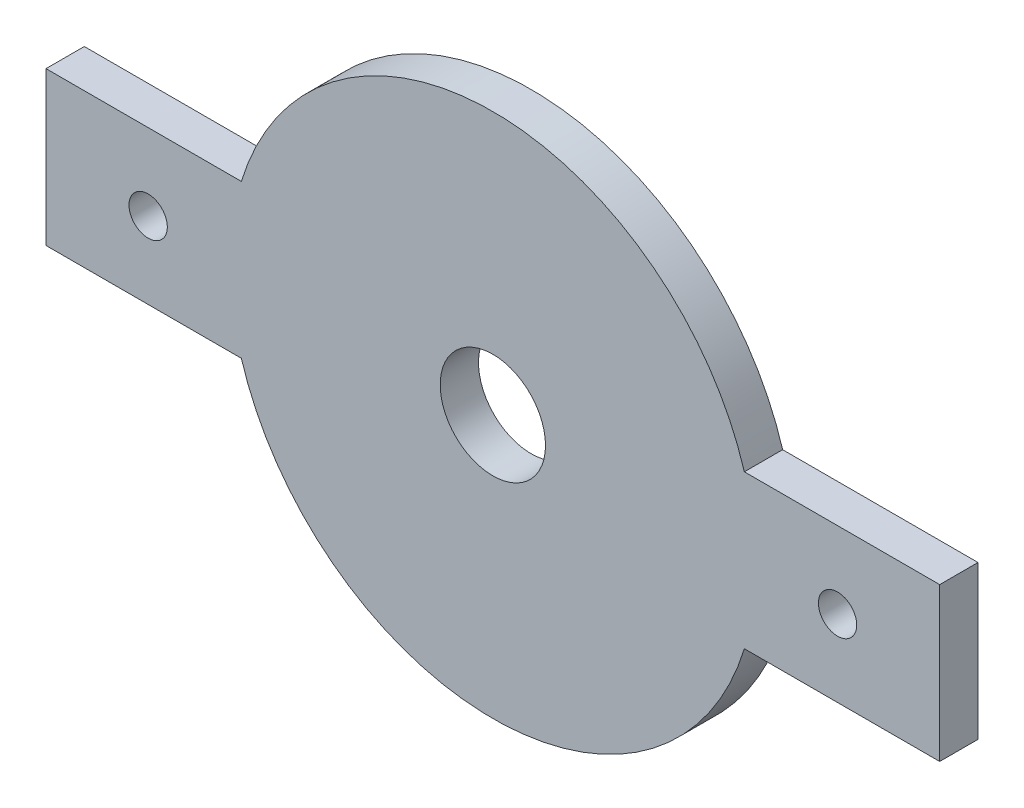
ISO-10303-21;
HEADER;
FILE_DESCRIPTION(('STEP AP214'),'2;1');
FILE_NAME('part.step','',(''),(''),'','','');
FILE_SCHEMA(('AUTOMOTIVE_DESIGN { 1 0 10303 214 1 1 1 1 }'));
ENDSEC;
DATA;
#1=APPLICATION_CONTEXT('core data for automotive mechanical design processes');
#2=APPLICATION_PROTOCOL_DEFINITION('international standard','automotive_design',2000,#1);
#3=PRODUCT_CONTEXT('',#1,'mechanical');
#4=PRODUCT('Part','Part','',(#3));
#5=PRODUCT_RELATED_PRODUCT_CATEGORY('part','',(#4));
#6=PRODUCT_DEFINITION_FORMATION('','',#4);
#7=PRODUCT_DEFINITION_CONTEXT('part definition',#1,'design');
#8=PRODUCT_DEFINITION('design','',#6,#7);
#9=PRODUCT_DEFINITION_SHAPE('','',#8);
#10=(LENGTH_UNIT() NAMED_UNIT(*) SI_UNIT(.MILLI.,.METRE.));
#11=(NAMED_UNIT(*) PLANE_ANGLE_UNIT() SI_UNIT($,.RADIAN.));
#12=(NAMED_UNIT(*) SI_UNIT($,.STERADIAN.) SOLID_ANGLE_UNIT());
#13=UNCERTAINTY_MEASURE_WITH_UNIT(LENGTH_MEASURE(1.E-05),#10,'distance_accuracy_value','');
#14=(GEOMETRIC_REPRESENTATION_CONTEXT(3) GLOBAL_UNCERTAINTY_ASSIGNED_CONTEXT((#13)) GLOBAL_UNIT_ASSIGNED_CONTEXT((#10,
#11,#12)) REPRESENTATION_CONTEXT('',''));
#15=CARTESIAN_POINT('',(0.,0.,0.));
#16=DIRECTION('',(0.,0.,1.));
#17=DIRECTION('',(1.,0.,0.));
#18=AXIS2_PLACEMENT_3D('',#15,#16,#17);
#19=CARTESIAN_POINT('',(0.,0.,4.));
#20=DIRECTION('',(0.,0.,-1.));
#21=DIRECTION('',(-1.,0.,0.));
#22=AXIS2_PLACEMENT_3D('',#19,#20,#21);
#23=CYLINDRICAL_SURFACE('',#22,20.5921091631052);
#24=CARTESIAN_POINT('',(0.,0.,4.));
#25=DIRECTION('',(0.,0.,1.));
#26=DIRECTION('',(1.,0.,0.));
#27=AXIS2_PLACEMENT_3D('',#24,#25,#26);
#28=CIRCLE('',#27,20.5921091631052);
#29=CARTESIAN_POINT('',(-19.6986029907007,-6.,4.));
#30=VERTEX_POINT('',#29);
#31=CARTESIAN_POINT('',(19.6986029907007,-6.,4.));
#32=VERTEX_POINT('',#31);
#33=EDGE_CURVE('E61',#30,#32,#28,.T.);
#34=ORIENTED_EDGE('',*,*,#33,.F.);
#35=DIRECTION('',(0.,0.,-1.));
#36=VECTOR('',#35,1.);
#37=CARTESIAN_POINT('',(-19.6986029907007,-6.,4.));
#38=LINE('',#37,#36);
#39=CARTESIAN_POINT('',(-19.6986029907007,-6.,1.));
#40=VERTEX_POINT('',#39);
#41=EDGE_CURVE('E179',#30,#40,#38,.T.);
#42=ORIENTED_EDGE('',*,*,#41,.T.);
#43=CARTESIAN_POINT('',(0.,0.,1.));
#44=DIRECTION('',(0.,0.,1.));
#45=DIRECTION('',(1.,0.,0.));
#46=AXIS2_PLACEMENT_3D('',#43,#44,#45);
#47=CIRCLE('',#46,20.5921091631052);
#48=CARTESIAN_POINT('',(19.6986029907007,-6.,1.));
#49=VERTEX_POINT('',#48);
#50=EDGE_CURVE('E69',#40,#49,#47,.T.);
#51=ORIENTED_EDGE('',*,*,#50,.T.);
#52=DIRECTION('',(0.,0.,-1.));
#53=VECTOR('',#52,1.);
#54=CARTESIAN_POINT('',(19.6986029907007,-6.,4.));
#55=LINE('',#54,#53);
#56=EDGE_CURVE('E177',#49,#32,#55,.F.);
#57=ORIENTED_EDGE('',*,*,#56,.T.);
#58=EDGE_LOOP('',(#34,#42,#51,#57));
#59=FACE_BOUND('',#58,.T.);
#60=ADVANCED_FACE('F52',(#59),#23,.T.);
#61=CARTESIAN_POINT('',(0.,0.,1.));
#62=DIRECTION('',(0.,0.,1.));
#63=DIRECTION('',(1.,0.,0.));
#64=AXIS2_PLACEMENT_3D('',#61,#62,#63);
#65=PLANE('',#64);
#66=CARTESIAN_POINT('',(19.6986029907007,6.,1.));
#67=VERTEX_POINT('',#66);
#68=CARTESIAN_POINT('',(-19.6986029907007,6.,1.));
#69=VERTEX_POINT('',#68);
#70=EDGE_CURVE('E77',#67,#69,#47,.T.);
#71=ORIENTED_EDGE('',*,*,#70,.F.);
#72=DIRECTION('',(1.,0.,0.));
#73=VECTOR('',#72,1.);
#74=CARTESIAN_POINT('',(35.,6.,1.));
#75=LINE('',#74,#73);
#76=CARTESIAN_POINT('',(35.,6.,1.));
#77=VERTEX_POINT('',#76);
#78=EDGE_CURVE('E162',#67,#77,#75,.T.);
#79=ORIENTED_EDGE('',*,*,#78,.T.);
#80=DIRECTION('',(0.,-1.,0.));
#81=VECTOR('',#80,1.);
#82=CARTESIAN_POINT('',(35.,-6.,1.));
#83=LINE('',#82,#81);
#84=CARTESIAN_POINT('',(35.,-6.,1.));
#85=VERTEX_POINT('',#84);
#86=EDGE_CURVE('E165',#77,#85,#83,.T.);
#87=ORIENTED_EDGE('',*,*,#86,.T.);
#88=DIRECTION('',(-1.,0.,0.));
#89=VECTOR('',#88,1.);
#90=CARTESIAN_POINT('',(35.,-6.,1.));
#91=LINE('',#90,#89);
#92=EDGE_CURVE('E146',#85,#49,#91,.T.);
#93=ORIENTED_EDGE('',*,*,#92,.T.);
#94=ORIENTED_EDGE('',*,*,#50,.F.);
#95=CARTESIAN_POINT('',(-35.,-6.,1.));
#96=VERTEX_POINT('',#95);
#97=EDGE_CURVE('E149',#40,#96,#91,.T.);
#98=ORIENTED_EDGE('',*,*,#97,.T.);
#99=DIRECTION('',(0.,1.,0.));
#100=VECTOR('',#99,1.);
#101=CARTESIAN_POINT('',(-35.,-6.,1.));
#102=LINE('',#101,#100);
#103=CARTESIAN_POINT('',(-35.,6.,1.));
#104=VERTEX_POINT('',#103);
#105=EDGE_CURVE('E160',#96,#104,#102,.T.);
#106=ORIENTED_EDGE('',*,*,#105,.T.);
#107=EDGE_CURVE('E124',#104,#69,#75,.T.);
#108=ORIENTED_EDGE('',*,*,#107,.T.);
#109=EDGE_LOOP('',(#71,#79,#87,#93,#94,#98,#106,#108));
#110=FACE_BOUND('',#109,.T.);
#111=CARTESIAN_POINT('',(0.,0.,1.));
#112=DIRECTION('',(0.,0.,1.));
#113=DIRECTION('',(1.,0.,0.));
#114=AXIS2_PLACEMENT_3D('',#111,#112,#113);
#115=CIRCLE('',#114,4.125);
#116=CARTESIAN_POINT('',(4.125,0.,1.));
#117=VERTEX_POINT('',#116);
#118=EDGE_CURVE('E56',#117,#117,#115,.T.);
#119=ORIENTED_EDGE('',*,*,#118,.T.);
#120=EDGE_LOOP('',(#119));
#121=FACE_BOUND('',#120,.T.);
#122=CARTESIAN_POINT('',(27.,0.,1.));
#123=DIRECTION('',(0.,0.,-1.));
#124=DIRECTION('',(-1.,0.,0.));
#125=AXIS2_PLACEMENT_3D('',#122,#123,#124);
#126=CIRCLE('',#125,1.5);
#127=CARTESIAN_POINT('',(25.5,0.,1.));
#128=VERTEX_POINT('',#127);
#129=EDGE_CURVE('E152',#128,#128,#126,.T.);
#130=ORIENTED_EDGE('',*,*,#129,.F.);
#131=EDGE_LOOP('',(#130));
#132=FACE_BOUND('',#131,.T.);
#133=CARTESIAN_POINT('',(-27.,0.,1.));
#134=DIRECTION('',(0.,0.,-1.));
#135=DIRECTION('',(-1.,0.,0.));
#136=AXIS2_PLACEMENT_3D('',#133,#134,#135);
#137=CIRCLE('',#136,1.5);
#138=CARTESIAN_POINT('',(-28.5,0.,1.));
#139=VERTEX_POINT('',#138);
#140=EDGE_CURVE('E255',#139,#139,#137,.T.);
#141=ORIENTED_EDGE('',*,*,#140,.F.);
#142=EDGE_LOOP('',(#141));
#143=FACE_BOUND('',#142,.T.);
#144=ADVANCED_FACE('F188',(#110,#121,#132,#143),#65,.F.);
#145=CARTESIAN_POINT('',(19.6986029907007,6.,4.));
#146=VERTEX_POINT('',#145);
#147=CARTESIAN_POINT('',(-19.6986029907007,6.,4.));
#148=VERTEX_POINT('',#147);
#149=EDGE_CURVE('E12',#146,#148,#28,.T.);
#150=ORIENTED_EDGE('',*,*,#149,.F.);
#151=DIRECTION('',(0.,0.,-1.));
#152=VECTOR('',#151,1.);
#153=CARTESIAN_POINT('',(19.6986029907007,6.,4.));
#154=LINE('',#153,#152);
#155=EDGE_CURVE('E175',#146,#67,#154,.T.);
#156=ORIENTED_EDGE('',*,*,#155,.T.);
#157=ORIENTED_EDGE('',*,*,#70,.T.);
#158=DIRECTION('',(0.,0.,-1.));
#159=VECTOR('',#158,1.);
#160=CARTESIAN_POINT('',(-19.6986029907007,6.,4.));
#161=LINE('',#160,#159);
#162=EDGE_CURVE('E169',#69,#148,#161,.F.);
#163=ORIENTED_EDGE('',*,*,#162,.T.);
#164=EDGE_LOOP('',(#150,#156,#157,#163));
#165=FACE_BOUND('',#164,.T.);
#166=ADVANCED_FACE('F202',(#165),#23,.T.);
#167=CARTESIAN_POINT('',(0.,0.,4.));
#168=DIRECTION('',(0.,0.,1.));
#169=DIRECTION('',(1.,0.,0.));
#170=AXIS2_PLACEMENT_3D('',#167,#168,#169);
#171=PLANE('',#170);
#172=ORIENTED_EDGE('',*,*,#149,.T.);
#173=DIRECTION('',(1.,0.,0.));
#174=VECTOR('',#173,1.);
#175=CARTESIAN_POINT('',(35.,6.,4.));
#176=LINE('',#175,#174);
#177=CARTESIAN_POINT('',(-35.,6.,4.));
#178=VERTEX_POINT('',#177);
#179=EDGE_CURVE('E122',#178,#148,#176,.T.);
#180=ORIENTED_EDGE('',*,*,#179,.F.);
#181=DIRECTION('',(0.,1.,0.));
#182=VECTOR('',#181,1.);
#183=CARTESIAN_POINT('',(-35.,-6.,4.));
#184=LINE('',#183,#182);
#185=CARTESIAN_POINT('',(-35.,-6.,4.));
#186=VERTEX_POINT('',#185);
#187=EDGE_CURVE('E137',#186,#178,#184,.T.);
#188=ORIENTED_EDGE('',*,*,#187,.F.);
#189=DIRECTION('',(-1.,0.,0.));
#190=VECTOR('',#189,1.);
#191=CARTESIAN_POINT('',(35.,-6.,4.));
#192=LINE('',#191,#190);
#193=EDGE_CURVE('E157',#30,#186,#192,.T.);
#194=ORIENTED_EDGE('',*,*,#193,.F.);
#195=ORIENTED_EDGE('',*,*,#33,.T.);
#196=CARTESIAN_POINT('',(35.,-6.,4.));
#197=VERTEX_POINT('',#196);
#198=EDGE_CURVE('E130',#197,#32,#192,.T.);
#199=ORIENTED_EDGE('',*,*,#198,.F.);
#200=DIRECTION('',(0.,-1.,0.));
#201=VECTOR('',#200,1.);
#202=CARTESIAN_POINT('',(35.,-6.,4.));
#203=LINE('',#202,#201);
#204=CARTESIAN_POINT('',(35.,6.,4.));
#205=VERTEX_POINT('',#204);
#206=EDGE_CURVE('E139',#205,#197,#203,.T.);
#207=ORIENTED_EDGE('',*,*,#206,.F.);
#208=EDGE_CURVE('E140',#146,#205,#176,.T.);
#209=ORIENTED_EDGE('',*,*,#208,.F.);
#210=EDGE_LOOP('',(#172,#180,#188,#194,#195,#199,#207,#209));
#211=FACE_BOUND('',#210,.T.);
#212=CARTESIAN_POINT('',(0.,0.,4.));
#213=DIRECTION('',(0.,0.,1.));
#214=DIRECTION('',(1.,0.,0.));
#215=AXIS2_PLACEMENT_3D('',#212,#213,#214);
#216=CIRCLE('',#215,4.125);
#217=CARTESIAN_POINT('',(4.125,0.,4.));
#218=VERTEX_POINT('',#217);
#219=EDGE_CURVE('E181',#218,#218,#216,.T.);
#220=ORIENTED_EDGE('',*,*,#219,.F.);
#221=EDGE_LOOP('',(#220));
#222=FACE_BOUND('',#221,.T.);
#223=CARTESIAN_POINT('',(27.,0.,4.));
#224=DIRECTION('',(0.,0.,-1.));
#225=DIRECTION('',(-1.,0.,0.));
#226=AXIS2_PLACEMENT_3D('',#223,#224,#225);
#227=CIRCLE('',#226,1.5);
#228=CARTESIAN_POINT('',(25.5,0.,4.));
#229=VERTEX_POINT('',#228);
#230=EDGE_CURVE('E163',#229,#229,#227,.T.);
#231=ORIENTED_EDGE('',*,*,#230,.T.);
#232=EDGE_LOOP('',(#231));
#233=FACE_BOUND('',#232,.T.);
#234=CARTESIAN_POINT('',(-27.,0.,4.));
#235=DIRECTION('',(0.,0.,-1.));
#236=DIRECTION('',(-1.,0.,0.));
#237=AXIS2_PLACEMENT_3D('',#234,#235,#236);
#238=CIRCLE('',#237,1.5);
#239=CARTESIAN_POINT('',(-28.5,0.,4.));
#240=VERTEX_POINT('',#239);
#241=EDGE_CURVE('E252',#240,#240,#238,.T.);
#242=ORIENTED_EDGE('',*,*,#241,.T.);
#243=EDGE_LOOP('',(#242));
#244=FACE_BOUND('',#243,.T.);
#245=ADVANCED_FACE('F134',(#211,#222,#233,#244),#171,.T.);
#246=CARTESIAN_POINT('',(0.,0.,4.));
#247=DIRECTION('',(0.,0.,-1.));
#248=DIRECTION('',(-1.,0.,0.));
#249=AXIS2_PLACEMENT_3D('',#246,#247,#248);
#250=CYLINDRICAL_SURFACE('',#249,4.125);
#251=ORIENTED_EDGE('',*,*,#219,.T.);
#252=EDGE_LOOP('',(#251));
#253=FACE_BOUND('',#252,.T.);
#254=ORIENTED_EDGE('',*,*,#118,.F.);
#255=EDGE_LOOP('',(#254));
#256=FACE_BOUND('',#255,.T.);
#257=ADVANCED_FACE('F54',(#253,#256),#250,.F.);
#258=CARTESIAN_POINT('',(35.,-6.,4.));
#259=DIRECTION('',(1.,0.,0.));
#260=DIRECTION('',(0.,0.,-1.));
#261=AXIS2_PLACEMENT_3D('',#258,#259,#260);
#262=PLANE('',#261);
#263=ORIENTED_EDGE('',*,*,#86,.F.);
#264=DIRECTION('',(0.,0.,-1.));
#265=VECTOR('',#264,1.);
#266=CARTESIAN_POINT('',(35.,6.,4.));
#267=LINE('',#266,#265);
#268=EDGE_CURVE('E129',#205,#77,#267,.T.);
#269=ORIENTED_EDGE('',*,*,#268,.F.);
#270=ORIENTED_EDGE('',*,*,#206,.T.);
#271=DIRECTION('',(0.,0.,-1.));
#272=VECTOR('',#271,1.);
#273=CARTESIAN_POINT('',(35.,-6.,4.));
#274=LINE('',#273,#272);
#275=EDGE_CURVE('E170',#197,#85,#274,.T.);
#276=ORIENTED_EDGE('',*,*,#275,.T.);
#277=EDGE_LOOP('',(#263,#269,#270,#276));
#278=FACE_BOUND('',#277,.T.);
#279=ADVANCED_FACE('F192',(#278),#262,.T.);
#280=CARTESIAN_POINT('',(27.,0.,4.));
#281=DIRECTION('',(0.,0.,-1.));
#282=DIRECTION('',(-1.,0.,0.));
#283=AXIS2_PLACEMENT_3D('',#280,#281,#282);
#284=CYLINDRICAL_SURFACE('',#283,1.5);
#285=ORIENTED_EDGE('',*,*,#230,.F.);
#286=EDGE_LOOP('',(#285));
#287=FACE_BOUND('',#286,.T.);
#288=ORIENTED_EDGE('',*,*,#129,.T.);
#289=EDGE_LOOP('',(#288));
#290=FACE_BOUND('',#289,.T.);
#291=ADVANCED_FACE('F198',(#287,#290),#284,.F.);
#292=CARTESIAN_POINT('',(35.,6.,4.));
#293=DIRECTION('',(0.,1.,0.));
#294=DIRECTION('',(0.,0.,1.));
#295=AXIS2_PLACEMENT_3D('',#292,#293,#294);
#296=PLANE('',#295);
#297=ORIENTED_EDGE('',*,*,#155,.F.);
#298=ORIENTED_EDGE('',*,*,#208,.T.);
#299=ORIENTED_EDGE('',*,*,#268,.T.);
#300=ORIENTED_EDGE('',*,*,#78,.F.);
#301=EDGE_LOOP('',(#297,#298,#299,#300));
#302=FACE_BOUND('',#301,.T.);
#303=ADVANCED_FACE('F217',(#302),#296,.T.);
#304=CARTESIAN_POINT('',(35.,-6.,4.));
#305=DIRECTION('',(0.,-1.,0.));
#306=DIRECTION('',(0.,0.,-1.));
#307=AXIS2_PLACEMENT_3D('',#304,#305,#306);
#308=PLANE('',#307);
#309=ORIENTED_EDGE('',*,*,#56,.F.);
#310=ORIENTED_EDGE('',*,*,#92,.F.);
#311=ORIENTED_EDGE('',*,*,#275,.F.);
#312=ORIENTED_EDGE('',*,*,#198,.T.);
#313=EDGE_LOOP('',(#309,#310,#311,#312));
#314=FACE_BOUND('',#313,.T.);
#315=ADVANCED_FACE('F225',(#314),#308,.T.);
#316=ORIENTED_EDGE('',*,*,#41,.F.);
#317=ORIENTED_EDGE('',*,*,#193,.T.);
#318=DIRECTION('',(0.,0.,-1.));
#319=VECTOR('',#318,1.);
#320=CARTESIAN_POINT('',(-35.,-6.,4.));
#321=LINE('',#320,#319);
#322=EDGE_CURVE('E145',#186,#96,#321,.T.);
#323=ORIENTED_EDGE('',*,*,#322,.T.);
#324=ORIENTED_EDGE('',*,*,#97,.F.);
#325=EDGE_LOOP('',(#316,#317,#323,#324));
#326=FACE_BOUND('',#325,.T.);
#327=ADVANCED_FACE('F228',(#326),#308,.T.);
#328=ORIENTED_EDGE('',*,*,#162,.F.);
#329=ORIENTED_EDGE('',*,*,#107,.F.);
#330=DIRECTION('',(0.,0.,-1.));
#331=VECTOR('',#330,1.);
#332=CARTESIAN_POINT('',(-35.,6.,4.));
#333=LINE('',#332,#331);
#334=EDGE_CURVE('E119',#178,#104,#333,.T.);
#335=ORIENTED_EDGE('',*,*,#334,.F.);
#336=ORIENTED_EDGE('',*,*,#179,.T.);
#337=EDGE_LOOP('',(#328,#329,#335,#336));
#338=FACE_BOUND('',#337,.T.);
#339=ADVANCED_FACE('F121',(#338),#296,.T.);
#340=CARTESIAN_POINT('',(-35.,-6.,4.));
#341=DIRECTION('',(-1.,0.,0.));
#342=DIRECTION('',(0.,0.,1.));
#343=AXIS2_PLACEMENT_3D('',#340,#341,#342);
#344=PLANE('',#343);
#345=ORIENTED_EDGE('',*,*,#105,.F.);
#346=ORIENTED_EDGE('',*,*,#322,.F.);
#347=ORIENTED_EDGE('',*,*,#187,.T.);
#348=ORIENTED_EDGE('',*,*,#334,.T.);
#349=EDGE_LOOP('',(#345,#346,#347,#348));
#350=FACE_BOUND('',#349,.T.);
#351=ADVANCED_FACE('F143',(#350),#344,.T.);
#352=CARTESIAN_POINT('',(-27.,0.,4.));
#353=DIRECTION('',(0.,0.,-1.));
#354=DIRECTION('',(-1.,0.,0.));
#355=AXIS2_PLACEMENT_3D('',#352,#353,#354);
#356=CYLINDRICAL_SURFACE('',#355,1.5);
#357=ORIENTED_EDGE('',*,*,#241,.F.);
#358=EDGE_LOOP('',(#357));
#359=FACE_BOUND('',#358,.T.);
#360=ORIENTED_EDGE('',*,*,#140,.T.);
#361=EDGE_LOOP('',(#360));
#362=FACE_BOUND('',#361,.T.);
#363=ADVANCED_FACE('F242',(#359,#362),#356,.F.);
#364=CLOSED_SHELL('',(#60,#144,#166,#245,#257,#279,#291,#303,#315,#327,#339,#351,#363));
#365=MANIFOLD_SOLID_BREP('B2',#364);
#366=ADVANCED_BREP_SHAPE_REPRESENTATION('',(#18,#365),#14);
#367=SHAPE_DEFINITION_REPRESENTATION(#9,#366);
ENDSEC;
END-ISO-10303-21;
